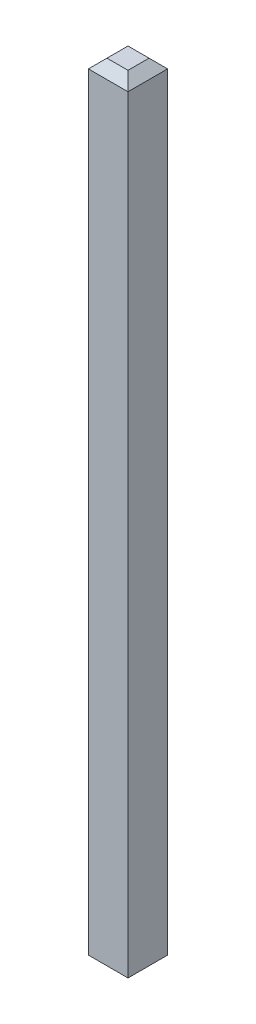
ISO-10303-21;
HEADER;
FILE_DESCRIPTION(('STEP AP214'),'2;1');
FILE_NAME('part.step','',(''),(''),'','','');
FILE_SCHEMA(('AUTOMOTIVE_DESIGN { 1 0 10303 214 1 1 1 1 }'));
ENDSEC;
DATA;
#1=APPLICATION_CONTEXT('core data for automotive mechanical design processes');
#2=APPLICATION_PROTOCOL_DEFINITION('international standard','automotive_design',2000,#1);
#3=PRODUCT_CONTEXT('',#1,'mechanical');
#4=PRODUCT('Part','Part','',(#3));
#5=PRODUCT_RELATED_PRODUCT_CATEGORY('part','',(#4));
#6=PRODUCT_DEFINITION_FORMATION('','',#4);
#7=PRODUCT_DEFINITION_CONTEXT('part definition',#1,'design');
#8=PRODUCT_DEFINITION('design','',#6,#7);
#9=PRODUCT_DEFINITION_SHAPE('','',#8);
#10=(LENGTH_UNIT() NAMED_UNIT(*) SI_UNIT(.MILLI.,.METRE.));
#11=(NAMED_UNIT(*) PLANE_ANGLE_UNIT() SI_UNIT($,.RADIAN.));
#12=(NAMED_UNIT(*) SI_UNIT($,.STERADIAN.) SOLID_ANGLE_UNIT());
#13=UNCERTAINTY_MEASURE_WITH_UNIT(LENGTH_MEASURE(1.E-05),#10,'distance_accuracy_value','');
#14=(GEOMETRIC_REPRESENTATION_CONTEXT(3) GLOBAL_UNCERTAINTY_ASSIGNED_CONTEXT((#13)) GLOBAL_UNIT_ASSIGNED_CONTEXT((#10,
#11,#12)) REPRESENTATION_CONTEXT('',''));
#15=CARTESIAN_POINT('',(0.,0.,0.));
#16=DIRECTION('',(0.,0.,1.));
#17=DIRECTION('',(1.,0.,0.));
#18=AXIS2_PLACEMENT_3D('',#15,#16,#17);
#19=CARTESIAN_POINT('',(-1.515,-1.925,-0.16));
#20=DIRECTION('',(-0.707106781186548,-0.707106781186548,0.));
#21=DIRECTION('',(0.707106781186548,-0.707106781186548,0.));
#22=AXIS2_PLACEMENT_3D('',#19,#20,#21);
#23=PLANE('',#22);
#24=DIRECTION('',(0.,0.,1.));
#25=VECTOR('',#24,1.);
#26=CARTESIAN_POINT('',(-1.44,-2.,0.));
#27=LINE('',#26,#25);
#28=CARTESIAN_POINT('',(-1.44,-2.,-0.17));
#29=VERTEX_POINT('',#28);
#30=CARTESIAN_POINT('',(-1.44,-2.,0.17));
#31=VERTEX_POINT('',#30);
#32=EDGE_CURVE('E20',#29,#31,#27,.T.);
#33=ORIENTED_EDGE('',*,*,#32,.T.);
#34=DIRECTION('',(0.577350269189627,-0.577350269189626,-0.577350269189625));
#35=VECTOR('',#34,1.);
#36=CARTESIAN_POINT('',(-1.59,-1.85,0.32));
#37=LINE('',#36,#35);
#38=CARTESIAN_POINT('',(-1.59,-1.85,0.32));
#39=VERTEX_POINT('',#38);
#40=EDGE_CURVE('E113',#39,#31,#37,.T.);
#41=ORIENTED_EDGE('',*,*,#40,.F.);
#42=DIRECTION('',(0.,0.,1.));
#43=VECTOR('',#42,1.);
#44=CARTESIAN_POINT('',(-1.59,-1.85,-0.32));
#45=LINE('',#44,#43);
#46=CARTESIAN_POINT('',(-1.59,-1.85,-0.32));
#47=VERTEX_POINT('',#46);
#48=EDGE_CURVE('E96',#47,#39,#45,.T.);
#49=ORIENTED_EDGE('',*,*,#48,.F.);
#50=DIRECTION('',(-0.577350269189627,0.577350269189626,-0.577350269189625));
#51=VECTOR('',#50,1.);
#52=CARTESIAN_POINT('',(-1.44,-2.,-0.17));
#53=LINE('',#52,#51);
#54=EDGE_CURVE('E94',#29,#47,#53,.T.);
#55=ORIENTED_EDGE('',*,*,#54,.F.);
#56=EDGE_LOOP('',(#33,#41,#49,#55));
#57=FACE_BOUND('',#56,.T.);
#58=ADVANCED_FACE('F17',(#57),#23,.T.);
#59=CARTESIAN_POINT('',(-1.515,10.625,-0.16));
#60=DIRECTION('',(-0.707106781186545,0.70710678118655,0.));
#61=DIRECTION('',(-0.70710678118655,-0.707106781186545,0.));
#62=AXIS2_PLACEMENT_3D('',#59,#60,#61);
#63=PLANE('',#62);
#64=DIRECTION('',(0.,0.,1.));
#65=VECTOR('',#64,1.);
#66=CARTESIAN_POINT('',(-1.59,10.55,-0.32));
#67=LINE('',#66,#65);
#68=CARTESIAN_POINT('',(-1.59,10.55,0.32));
#69=VERTEX_POINT('',#68);
#70=CARTESIAN_POINT('',(-1.59,10.55,-0.32));
#71=VERTEX_POINT('',#70);
#72=EDGE_CURVE('E121',#69,#71,#67,.F.);
#73=ORIENTED_EDGE('',*,*,#72,.F.);
#74=DIRECTION('',(-0.577350269189627,-0.577350269189623,0.577350269189627));
#75=VECTOR('',#74,1.);
#76=CARTESIAN_POINT('',(-1.44,10.7,0.170000000000001));
#77=LINE('',#76,#75);
#78=CARTESIAN_POINT('',(-1.44,10.7,0.17));
#79=VERTEX_POINT('',#78);
#80=EDGE_CURVE('E118',#79,#69,#77,.T.);
#81=ORIENTED_EDGE('',*,*,#80,.F.);
#82=DIRECTION('',(0.,0.,1.));
#83=VECTOR('',#82,1.);
#84=CARTESIAN_POINT('',(-1.44,10.7,0.));
#85=LINE('',#84,#83);
#86=CARTESIAN_POINT('',(-1.44,10.7,-0.17));
#87=VERTEX_POINT('',#86);
#88=EDGE_CURVE('E79',#87,#79,#85,.T.);
#89=ORIENTED_EDGE('',*,*,#88,.F.);
#90=DIRECTION('',(0.577350269189627,0.577350269189623,0.577350269189627));
#91=VECTOR('',#90,1.);
#92=CARTESIAN_POINT('',(-1.59,10.55,-0.320000000000001));
#93=LINE('',#92,#91);
#94=EDGE_CURVE('E109',#71,#87,#93,.T.);
#95=ORIENTED_EDGE('',*,*,#94,.F.);
#96=EDGE_LOOP('',(#73,#81,#89,#95));
#97=FACE_BOUND('',#96,.T.);
#98=ADVANCED_FACE('F283',(#97),#63,.T.);
#99=CARTESIAN_POINT('',(-1.27,-2.,0.));
#100=DIRECTION('',(0.,1.,0.));
#101=DIRECTION('',(0.,0.,1.));
#102=AXIS2_PLACEMENT_3D('',#99,#100,#101);
#103=PLANE('',#102);
#104=DIRECTION('',(0.,0.,1.));
#105=VECTOR('',#104,1.);
#106=CARTESIAN_POINT('',(-1.1,-2.,0.16));
#107=LINE('',#106,#105);
#108=CARTESIAN_POINT('',(-1.1,-2.,0.17));
#109=VERTEX_POINT('',#108);
#110=CARTESIAN_POINT('',(-1.1,-2.,-0.17));
#111=VERTEX_POINT('',#110);
#112=EDGE_CURVE('E124',#109,#111,#107,.F.);
#113=ORIENTED_EDGE('',*,*,#112,.F.);
#114=DIRECTION('',(1.,0.,0.));
#115=VECTOR('',#114,1.);
#116=CARTESIAN_POINT('',(-1.43,-2.,0.17));
#117=LINE('',#116,#115);
#118=EDGE_CURVE('E90',#31,#109,#117,.T.);
#119=ORIENTED_EDGE('',*,*,#118,.F.);
#120=ORIENTED_EDGE('',*,*,#32,.F.);
#121=DIRECTION('',(1.,0.,0.));
#122=VECTOR('',#121,1.);
#123=CARTESIAN_POINT('',(-1.11,-2.,-0.17));
#124=LINE('',#123,#122);
#125=EDGE_CURVE('E87',#111,#29,#124,.F.);
#126=ORIENTED_EDGE('',*,*,#125,.F.);
#127=EDGE_LOOP('',(#113,#119,#120,#126));
#128=FACE_BOUND('',#127,.T.);
#129=ADVANCED_FACE('F85',(#128),#103,.F.);
#130=CARTESIAN_POINT('',(-1.11,-1.925,-0.245));
#131=DIRECTION('',(0.,-0.707106781186547,-0.707106781186548));
#132=DIRECTION('',(0.,0.707106781186548,-0.707106781186547));
#133=AXIS2_PLACEMENT_3D('',#130,#131,#132);
#134=PLANE('',#133);
#135=DIRECTION('',(-1.,0.,0.));
#136=VECTOR('',#135,1.);
#137=CARTESIAN_POINT('',(-0.95,-1.85,-0.32));
#138=LINE('',#137,#136);
#139=CARTESIAN_POINT('',(-0.95,-1.85,-0.32));
#140=VERTEX_POINT('',#139);
#141=EDGE_CURVE('E130',#140,#47,#138,.T.);
#142=ORIENTED_EDGE('',*,*,#141,.F.);
#143=DIRECTION('',(0.577350269189625,0.577350269189626,-0.577350269189626));
#144=VECTOR('',#143,1.);
#145=CARTESIAN_POINT('',(-1.1,-2.,-0.17));
#146=LINE('',#145,#144);
#147=EDGE_CURVE('E102',#111,#140,#146,.T.);
#148=ORIENTED_EDGE('',*,*,#147,.F.);
#149=ORIENTED_EDGE('',*,*,#125,.T.);
#150=ORIENTED_EDGE('',*,*,#54,.T.);
#151=EDGE_LOOP('',(#142,#148,#149,#150));
#152=FACE_BOUND('',#151,.T.);
#153=ADVANCED_FACE('F100',(#152),#134,.T.);
#154=CARTESIAN_POINT('',(-1.27,10.7,0.));
#155=DIRECTION('',(0.,1.,0.));
#156=DIRECTION('',(0.,0.,1.));
#157=AXIS2_PLACEMENT_3D('',#154,#155,#156);
#158=PLANE('',#157);
#159=DIRECTION('',(0.,0.,1.));
#160=VECTOR('',#159,1.);
#161=CARTESIAN_POINT('',(-1.1,10.7,0.16));
#162=LINE('',#161,#160);
#163=CARTESIAN_POINT('',(-1.1,10.7,-0.17));
#164=VERTEX_POINT('',#163);
#165=CARTESIAN_POINT('',(-1.1,10.7,0.17));
#166=VERTEX_POINT('',#165);
#167=EDGE_CURVE('E139',#164,#166,#162,.T.);
#168=ORIENTED_EDGE('',*,*,#167,.F.);
#169=DIRECTION('',(1.,0.,0.));
#170=VECTOR('',#169,1.);
#171=CARTESIAN_POINT('',(-1.11,10.7,-0.170000000000001));
#172=LINE('',#171,#170);
#173=EDGE_CURVE('E106',#87,#164,#172,.T.);
#174=ORIENTED_EDGE('',*,*,#173,.F.);
#175=ORIENTED_EDGE('',*,*,#88,.T.);
#176=DIRECTION('',(1.,0.,0.));
#177=VECTOR('',#176,1.);
#178=CARTESIAN_POINT('',(-1.43,10.7,0.170000000000001));
#179=LINE('',#178,#177);
#180=EDGE_CURVE('E115',#166,#79,#179,.F.);
#181=ORIENTED_EDGE('',*,*,#180,.F.);
#182=EDGE_LOOP('',(#168,#174,#175,#181));
#183=FACE_BOUND('',#182,.T.);
#184=ADVANCED_FACE('F259',(#183),#158,.T.);
#185=CARTESIAN_POINT('',(-1.11,10.625,-0.245));
#186=DIRECTION('',(0.,0.70710678118655,-0.707106781186545));
#187=DIRECTION('',(0.,0.707106781186545,0.70710678118655));
#188=AXIS2_PLACEMENT_3D('',#185,#186,#187);
#189=PLANE('',#188);
#190=DIRECTION('',(-1.,0.,0.));
#191=VECTOR('',#190,1.);
#192=CARTESIAN_POINT('',(-0.95,10.55,-0.32));
#193=LINE('',#192,#191);
#194=CARTESIAN_POINT('',(-0.95,10.55,-0.32));
#195=VERTEX_POINT('',#194);
#196=EDGE_CURVE('E136',#71,#195,#193,.F.);
#197=ORIENTED_EDGE('',*,*,#196,.F.);
#198=ORIENTED_EDGE('',*,*,#94,.T.);
#199=ORIENTED_EDGE('',*,*,#173,.T.);
#200=DIRECTION('',(-0.577350269189627,0.577350269189623,0.577350269189627));
#201=VECTOR('',#200,1.);
#202=CARTESIAN_POINT('',(-0.949999999999999,10.55,-0.32));
#203=LINE('',#202,#201);
#204=EDGE_CURVE('E144',#195,#164,#203,.T.);
#205=ORIENTED_EDGE('',*,*,#204,.F.);
#206=EDGE_LOOP('',(#197,#198,#199,#205));
#207=FACE_BOUND('',#206,.T.);
#208=ADVANCED_FACE('F251',(#207),#189,.T.);
#209=CARTESIAN_POINT('',(-1.43,-1.925,0.245));
#210=DIRECTION('',(0.,-0.707106781186547,0.707106781186548));
#211=DIRECTION('',(0.,-0.707106781186548,-0.707106781186547));
#212=AXIS2_PLACEMENT_3D('',#209,#210,#211);
#213=PLANE('',#212);
#214=DIRECTION('',(1.,0.,0.));
#215=VECTOR('',#214,1.);
#216=CARTESIAN_POINT('',(-1.59,-1.85,0.32));
#217=LINE('',#216,#215);
#218=CARTESIAN_POINT('',(-0.95,-1.85,0.32));
#219=VERTEX_POINT('',#218);
#220=EDGE_CURVE('E147',#39,#219,#217,.T.);
#221=ORIENTED_EDGE('',*,*,#220,.F.);
#222=ORIENTED_EDGE('',*,*,#40,.T.);
#223=ORIENTED_EDGE('',*,*,#118,.T.);
#224=DIRECTION('',(-0.577350269189626,-0.577350269189626,-0.577350269189626));
#225=VECTOR('',#224,1.);
#226=CARTESIAN_POINT('',(-0.95,-1.85,0.32));
#227=LINE('',#226,#225);
#228=EDGE_CURVE('E127',#219,#109,#227,.T.);
#229=ORIENTED_EDGE('',*,*,#228,.F.);
#230=EDGE_LOOP('',(#221,#222,#223,#229));
#231=FACE_BOUND('',#230,.T.);
#232=ADVANCED_FACE('F173',(#231),#213,.T.);
#233=CARTESIAN_POINT('',(-1.43,10.625,0.245));
#234=DIRECTION('',(0.,0.70710678118655,0.707106781186545));
#235=DIRECTION('',(0.,-0.707106781186545,0.70710678118655));
#236=AXIS2_PLACEMENT_3D('',#233,#234,#235);
#237=PLANE('',#236);
#238=ORIENTED_EDGE('',*,*,#180,.T.);
#239=ORIENTED_EDGE('',*,*,#80,.T.);
#240=DIRECTION('',(1.,0.,0.));
#241=VECTOR('',#240,1.);
#242=CARTESIAN_POINT('',(-1.59,10.55,0.32));
#243=LINE('',#242,#241);
#244=CARTESIAN_POINT('',(-0.95,10.55,0.32));
#245=VERTEX_POINT('',#244);
#246=EDGE_CURVE('E35',#245,#69,#243,.F.);
#247=ORIENTED_EDGE('',*,*,#246,.F.);
#248=DIRECTION('',(0.577350269189627,-0.577350269189623,0.577350269189627));
#249=VECTOR('',#248,1.);
#250=CARTESIAN_POINT('',(-1.1,10.7,0.17));
#251=LINE('',#250,#249);
#252=EDGE_CURVE('E142',#166,#245,#251,.T.);
#253=ORIENTED_EDGE('',*,*,#252,.F.);
#254=EDGE_LOOP('',(#238,#239,#247,#253));
#255=FACE_BOUND('',#254,.T.);
#256=ADVANCED_FACE('F190',(#255),#237,.T.);
#257=CARTESIAN_POINT('',(-1.59,-2.,-0.32));
#258=DIRECTION('',(-1.,0.,0.));
#259=DIRECTION('',(0.,0.,1.));
#260=AXIS2_PLACEMENT_3D('',#257,#258,#259);
#261=PLANE('',#260);
#262=ORIENTED_EDGE('',*,*,#72,.T.);
#263=DIRECTION('',(0.,1.,0.));
#264=VECTOR('',#263,1.);
#265=CARTESIAN_POINT('',(-1.59,-2.,-0.32));
#266=LINE('',#265,#264);
#267=EDGE_CURVE('E133',#47,#71,#266,.T.);
#268=ORIENTED_EDGE('',*,*,#267,.F.);
#269=ORIENTED_EDGE('',*,*,#48,.T.);
#270=DIRECTION('',(0.,1.,0.));
#271=VECTOR('',#270,1.);
#272=CARTESIAN_POINT('',(-1.59,-2.,0.32));
#273=LINE('',#272,#271);
#274=EDGE_CURVE('E151',#69,#39,#273,.F.);
#275=ORIENTED_EDGE('',*,*,#274,.F.);
#276=EDGE_LOOP('',(#262,#268,#269,#275));
#277=FACE_BOUND('',#276,.T.);
#278=ADVANCED_FACE('F176',(#277),#261,.T.);
#279=CARTESIAN_POINT('',(-1.025,-1.925,0.16));
#280=DIRECTION('',(0.707106781186548,-0.707106781186547,0.));
#281=DIRECTION('',(0.707106781186547,0.707106781186548,0.));
#282=AXIS2_PLACEMENT_3D('',#279,#280,#281);
#283=PLANE('',#282);
#284=DIRECTION('',(0.,0.,-1.));
#285=VECTOR('',#284,1.);
#286=CARTESIAN_POINT('',(-0.95,-1.85,0.32));
#287=LINE('',#286,#285);
#288=EDGE_CURVE('E154',#219,#140,#287,.T.);
#289=ORIENTED_EDGE('',*,*,#288,.F.);
#290=ORIENTED_EDGE('',*,*,#228,.T.);
#291=ORIENTED_EDGE('',*,*,#112,.T.);
#292=ORIENTED_EDGE('',*,*,#147,.T.);
#293=EDGE_LOOP('',(#289,#290,#291,#292));
#294=FACE_BOUND('',#293,.T.);
#295=ADVANCED_FACE('F181',(#294),#283,.T.);
#296=CARTESIAN_POINT('',(-0.95,-2.,-0.32));
#297=DIRECTION('',(0.,0.,-1.));
#298=DIRECTION('',(-1.,0.,0.));
#299=AXIS2_PLACEMENT_3D('',#296,#297,#298);
#300=PLANE('',#299);
#301=ORIENTED_EDGE('',*,*,#196,.T.);
#302=DIRECTION('',(0.,1.,0.));
#303=VECTOR('',#302,1.);
#304=CARTESIAN_POINT('',(-0.95,-2.,-0.32));
#305=LINE('',#304,#303);
#306=EDGE_CURVE('E157',#140,#195,#305,.T.);
#307=ORIENTED_EDGE('',*,*,#306,.F.);
#308=ORIENTED_EDGE('',*,*,#141,.T.);
#309=ORIENTED_EDGE('',*,*,#267,.T.);
#310=EDGE_LOOP('',(#301,#307,#308,#309));
#311=FACE_BOUND('',#310,.T.);
#312=ADVANCED_FACE('F179',(#311),#300,.T.);
#313=CARTESIAN_POINT('',(-1.025,10.625,0.16));
#314=DIRECTION('',(0.707106781186545,0.70710678118655,0.));
#315=DIRECTION('',(-0.70710678118655,0.707106781186545,0.));
#316=AXIS2_PLACEMENT_3D('',#313,#314,#315);
#317=PLANE('',#316);
#318=DIRECTION('',(0.,0.,-1.));
#319=VECTOR('',#318,1.);
#320=CARTESIAN_POINT('',(-0.95,10.55,0.32));
#321=LINE('',#320,#319);
#322=EDGE_CURVE('E26',#195,#245,#321,.F.);
#323=ORIENTED_EDGE('',*,*,#322,.F.);
#324=ORIENTED_EDGE('',*,*,#204,.T.);
#325=ORIENTED_EDGE('',*,*,#167,.T.);
#326=ORIENTED_EDGE('',*,*,#252,.T.);
#327=EDGE_LOOP('',(#323,#324,#325,#326));
#328=FACE_BOUND('',#327,.T.);
#329=ADVANCED_FACE('F167',(#328),#317,.T.);
#330=CARTESIAN_POINT('',(-1.59,-2.,0.32));
#331=DIRECTION('',(0.,0.,1.));
#332=DIRECTION('',(1.,0.,0.));
#333=AXIS2_PLACEMENT_3D('',#330,#331,#332);
#334=PLANE('',#333);
#335=ORIENTED_EDGE('',*,*,#246,.T.);
#336=ORIENTED_EDGE('',*,*,#274,.T.);
#337=ORIENTED_EDGE('',*,*,#220,.T.);
#338=DIRECTION('',(0.,1.,0.));
#339=VECTOR('',#338,1.);
#340=CARTESIAN_POINT('',(-0.95,-2.,0.32));
#341=LINE('',#340,#339);
#342=EDGE_CURVE('E11',#245,#219,#341,.F.);
#343=ORIENTED_EDGE('',*,*,#342,.F.);
#344=EDGE_LOOP('',(#335,#336,#337,#343));
#345=FACE_BOUND('',#344,.T.);
#346=ADVANCED_FACE('F169',(#345),#334,.T.);
#347=CARTESIAN_POINT('',(-0.95,-2.,0.32));
#348=DIRECTION('',(1.,0.,0.));
#349=DIRECTION('',(0.,0.,-1.));
#350=AXIS2_PLACEMENT_3D('',#347,#348,#349);
#351=PLANE('',#350);
#352=ORIENTED_EDGE('',*,*,#322,.T.);
#353=ORIENTED_EDGE('',*,*,#342,.T.);
#354=ORIENTED_EDGE('',*,*,#288,.T.);
#355=ORIENTED_EDGE('',*,*,#306,.T.);
#356=EDGE_LOOP('',(#352,#353,#354,#355));
#357=FACE_BOUND('',#356,.T.);
#358=ADVANCED_FACE('F163',(#357),#351,.T.);
#359=CLOSED_SHELL('',(#58,#98,#129,#153,#184,#208,#232,#256,#278,#295,#312,#329,#346,#358));
#360=MANIFOLD_SOLID_BREP('B1',#359);
#361=ADVANCED_BREP_SHAPE_REPRESENTATION('',(#18,#360),#14);
#362=SHAPE_DEFINITION_REPRESENTATION(#9,#361);
ENDSEC;
END-ISO-10303-21;
